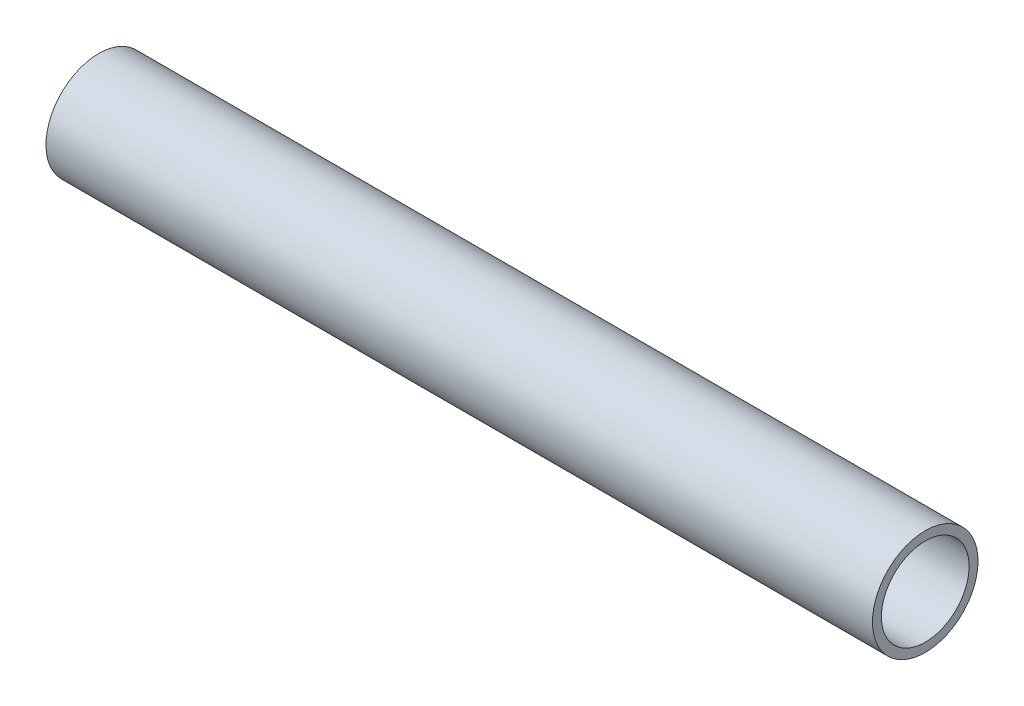
ISO-10303-21;
HEADER;
FILE_DESCRIPTION(('STEP AP214'),'2;1');
FILE_NAME('part.step','',(''),(''),'','','');
FILE_SCHEMA(('AUTOMOTIVE_DESIGN { 1 0 10303 214 1 1 1 1 }'));
ENDSEC;
DATA;
#1=APPLICATION_CONTEXT('core data for automotive mechanical design processes');
#2=APPLICATION_PROTOCOL_DEFINITION('international standard','automotive_design',2000,#1);
#3=PRODUCT_CONTEXT('',#1,'mechanical');
#4=PRODUCT('Part','Part','',(#3));
#5=PRODUCT_RELATED_PRODUCT_CATEGORY('part','',(#4));
#6=PRODUCT_DEFINITION_FORMATION('','',#4);
#7=PRODUCT_DEFINITION_CONTEXT('part definition',#1,'design');
#8=PRODUCT_DEFINITION('design','',#6,#7);
#9=PRODUCT_DEFINITION_SHAPE('','',#8);
#10=(LENGTH_UNIT() NAMED_UNIT(*) SI_UNIT(.MILLI.,.METRE.));
#11=(NAMED_UNIT(*) PLANE_ANGLE_UNIT() SI_UNIT($,.RADIAN.));
#12=(NAMED_UNIT(*) SI_UNIT($,.STERADIAN.) SOLID_ANGLE_UNIT());
#13=UNCERTAINTY_MEASURE_WITH_UNIT(LENGTH_MEASURE(1.E-05),#10,'distance_accuracy_value','');
#14=(GEOMETRIC_REPRESENTATION_CONTEXT(3) GLOBAL_UNCERTAINTY_ASSIGNED_CONTEXT((#13)) GLOBAL_UNIT_ASSIGNED_CONTEXT((#10,
#11,#12)) REPRESENTATION_CONTEXT('',''));
#15=CARTESIAN_POINT('',(0.,0.,0.));
#16=DIRECTION('',(0.,0.,1.));
#17=DIRECTION('',(1.,0.,0.));
#18=AXIS2_PLACEMENT_3D('',#15,#16,#17);
#19=CARTESIAN_POINT('',(165.1,-194.818,2112.518));
#20=DIRECTION('',(-1.,0.,0.));
#21=DIRECTION('',(0.,0.,1.));
#22=AXIS2_PLACEMENT_3D('',#19,#20,#21);
#23=CYLINDRICAL_SURFACE('',#22,17.526);
#24=CARTESIAN_POINT('',(165.1,-194.818,2112.518));
#25=DIRECTION('',(1.,0.,0.));
#26=DIRECTION('',(0.,1.,0.));
#27=AXIS2_PLACEMENT_3D('',#24,#25,#26);
#28=CIRCLE('',#27,17.526);
#29=CARTESIAN_POINT('',(165.1,-177.292,2112.518));
#30=VERTEX_POINT('',#29);
#31=EDGE_CURVE('E22',#30,#30,#28,.T.);
#32=ORIENTED_EDGE('',*,*,#31,.T.);
#33=EDGE_LOOP('',(#32));
#34=FACE_BOUND('',#33,.T.);
#35=CARTESIAN_POINT('',(-165.1,-194.818,2112.518));
#36=DIRECTION('',(1.,0.,0.));
#37=DIRECTION('',(0.,1.,0.));
#38=AXIS2_PLACEMENT_3D('',#35,#36,#37);
#39=CIRCLE('',#38,17.526);
#40=CARTESIAN_POINT('',(-165.1,-177.292,2112.518));
#41=VERTEX_POINT('',#40);
#42=EDGE_CURVE('E33',#41,#41,#39,.T.);
#43=ORIENTED_EDGE('',*,*,#42,.F.);
#44=EDGE_LOOP('',(#43));
#45=FACE_BOUND('',#44,.T.);
#46=ADVANCED_FACE('F14',(#34,#45),#23,.F.);
#47=CARTESIAN_POINT('',(165.1,-194.818,2112.518));
#48=DIRECTION('',(-1.,0.,0.));
#49=DIRECTION('',(0.,0.,1.));
#50=AXIS2_PLACEMENT_3D('',#47,#48,#49);
#51=CYLINDRICAL_SURFACE('',#50,21.082);
#52=CARTESIAN_POINT('',(165.1,-194.818,2112.518));
#53=DIRECTION('',(1.,0.,0.));
#54=DIRECTION('',(0.,1.,0.));
#55=AXIS2_PLACEMENT_3D('',#52,#53,#54);
#56=CIRCLE('',#55,21.082);
#57=CARTESIAN_POINT('',(165.1,-173.736,2112.518));
#58=VERTEX_POINT('',#57);
#59=EDGE_CURVE('E10',#58,#58,#56,.T.);
#60=ORIENTED_EDGE('',*,*,#59,.F.);
#61=EDGE_LOOP('',(#60));
#62=FACE_BOUND('',#61,.T.);
#63=CARTESIAN_POINT('',(-165.1,-194.818,2112.518));
#64=DIRECTION('',(1.,0.,0.));
#65=DIRECTION('',(0.,1.,0.));
#66=AXIS2_PLACEMENT_3D('',#63,#64,#65);
#67=CIRCLE('',#66,21.082);
#68=CARTESIAN_POINT('',(-165.1,-173.736,2112.518));
#69=VERTEX_POINT('',#68);
#70=EDGE_CURVE('E17',#69,#69,#67,.T.);
#71=ORIENTED_EDGE('',*,*,#70,.T.);
#72=EDGE_LOOP('',(#71));
#73=FACE_BOUND('',#72,.T.);
#74=ADVANCED_FACE('F42',(#62,#73),#51,.T.);
#75=CARTESIAN_POINT('',(165.1,266.7,2108.2));
#76=DIRECTION('',(1.,0.,0.));
#77=DIRECTION('',(0.,1.,0.));
#78=AXIS2_PLACEMENT_3D('',#75,#76,#77);
#79=PLANE('',#78);
#80=ORIENTED_EDGE('',*,*,#31,.F.);
#81=EDGE_LOOP('',(#80));
#82=FACE_BOUND('',#81,.T.);
#83=ORIENTED_EDGE('',*,*,#59,.T.);
#84=EDGE_LOOP('',(#83));
#85=FACE_BOUND('',#84,.T.);
#86=ADVANCED_FACE('F46',(#82,#85),#79,.T.);
#87=CARTESIAN_POINT('',(-165.1,266.7,2108.2));
#88=DIRECTION('',(1.,0.,0.));
#89=DIRECTION('',(0.,1.,0.));
#90=AXIS2_PLACEMENT_3D('',#87,#88,#89);
#91=PLANE('',#90);
#92=ORIENTED_EDGE('',*,*,#42,.T.);
#93=EDGE_LOOP('',(#92));
#94=FACE_BOUND('',#93,.T.);
#95=ORIENTED_EDGE('',*,*,#70,.F.);
#96=EDGE_LOOP('',(#95));
#97=FACE_BOUND('',#96,.T.);
#98=ADVANCED_FACE('F44',(#94,#97),#91,.F.);
#99=CLOSED_SHELL('',(#46,#74,#86,#98));
#100=MANIFOLD_SOLID_BREP('B1',#99);
#101=ADVANCED_BREP_SHAPE_REPRESENTATION('',(#18,#100),#14);
#102=SHAPE_DEFINITION_REPRESENTATION(#9,#101);
ENDSEC;
END-ISO-10303-21;
